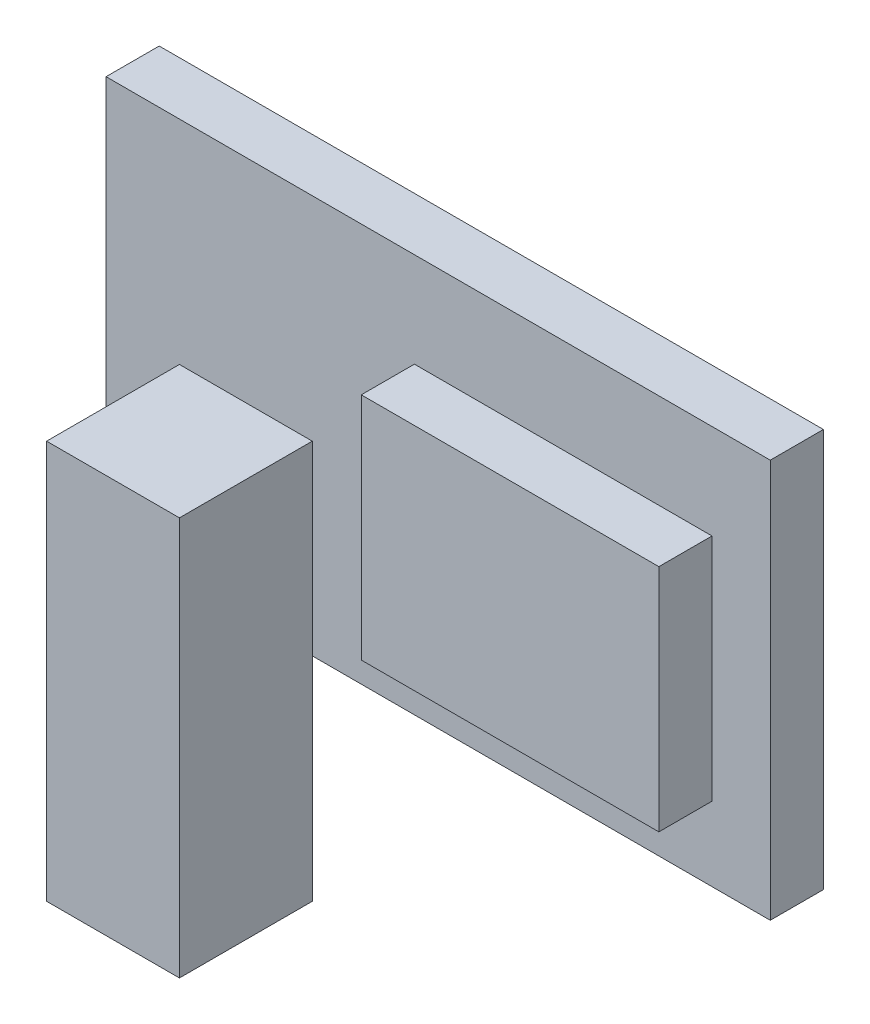
ISO-10303-21;
HEADER;
FILE_DESCRIPTION(('STEP AP214'),'2;1');
FILE_NAME('part.step','',(''),(''),'','','');
FILE_SCHEMA(('AUTOMOTIVE_DESIGN { 1 0 10303 214 1 1 1 1 }'));
ENDSEC;
DATA;
#1=APPLICATION_CONTEXT('core data for automotive mechanical design processes');
#2=APPLICATION_PROTOCOL_DEFINITION('international standard','automotive_design',2000,#1);
#3=PRODUCT_CONTEXT('',#1,'mechanical');
#4=PRODUCT('Part','Part','',(#3));
#5=PRODUCT_RELATED_PRODUCT_CATEGORY('part','',(#4));
#6=PRODUCT_DEFINITION_FORMATION('','',#4);
#7=PRODUCT_DEFINITION_CONTEXT('part definition',#1,'design');
#8=PRODUCT_DEFINITION('design','',#6,#7);
#9=PRODUCT_DEFINITION_SHAPE('','',#8);
#10=(LENGTH_UNIT() NAMED_UNIT(*) SI_UNIT(.MILLI.,.METRE.));
#11=(NAMED_UNIT(*) PLANE_ANGLE_UNIT() SI_UNIT($,.RADIAN.));
#12=(NAMED_UNIT(*) SI_UNIT($,.STERADIAN.) SOLID_ANGLE_UNIT());
#13=UNCERTAINTY_MEASURE_WITH_UNIT(LENGTH_MEASURE(1.E-05),#10,'distance_accuracy_value','');
#14=(GEOMETRIC_REPRESENTATION_CONTEXT(3) GLOBAL_UNCERTAINTY_ASSIGNED_CONTEXT((#13)) GLOBAL_UNIT_ASSIGNED_CONTEXT((#10,
#11,#12)) REPRESENTATION_CONTEXT('',''));
#15=CARTESIAN_POINT('',(0.,0.,0.));
#16=DIRECTION('',(0.,0.,1.));
#17=DIRECTION('',(1.,0.,0.));
#18=AXIS2_PLACEMENT_3D('',#15,#16,#17);
#19=CARTESIAN_POINT('',(0.,0.,2.));
#20=DIRECTION('',(0.,0.,1.));
#21=DIRECTION('',(1.,0.,0.));
#22=AXIS2_PLACEMENT_3D('',#19,#20,#21);
#23=PLANE('',#22);
#24=DIRECTION('',(0.,-1.,0.));
#25=VECTOR('',#24,1.);
#26=CARTESIAN_POINT('',(-11.5842220647906,-3.90346801005655,2.));
#27=LINE('',#26,#25);
#28=CARTESIAN_POINT('',(-11.5842220647906,-3.90346801005655,2.));
#29=VERTEX_POINT('',#28);
#30=CARTESIAN_POINT('',(-11.5842220647906,-10.9034680100565,2.));
#31=VERTEX_POINT('',#30);
#32=EDGE_CURVE('E223',#29,#31,#27,.T.);
#33=ORIENTED_EDGE('',*,*,#32,.F.);
#34=DIRECTION('',(-1.,0.,0.));
#35=VECTOR('',#34,1.);
#36=CARTESIAN_POINT('',(0.,-3.90346801005655,2.));
#37=LINE('',#36,#35);
#38=CARTESIAN_POINT('',(-6.5842220647906,-3.90346801005655,2.));
#39=VERTEX_POINT('',#38);
#40=EDGE_CURVE('E160',#39,#29,#37,.T.);
#41=ORIENTED_EDGE('',*,*,#40,.F.);
#42=DIRECTION('',(0.,-1.,0.));
#43=VECTOR('',#42,1.);
#44=CARTESIAN_POINT('',(-6.5842220647906,-3.90346801005655,2.));
#45=LINE('',#44,#43);
#46=CARTESIAN_POINT('',(-6.5842220647906,-10.9034680100565,2.));
#47=VERTEX_POINT('',#46);
#48=EDGE_CURVE('E219',#39,#47,#45,.T.);
#49=ORIENTED_EDGE('',*,*,#48,.T.);
#50=DIRECTION('',(1.,0.,0.));
#51=VECTOR('',#50,1.);
#52=CARTESIAN_POINT('',(-14.3456106753076,-10.9034680100565,2.));
#53=LINE('',#52,#51);
#54=CARTESIAN_POINT('',(10.6543893246924,-10.9034680100565,2.));
#55=VERTEX_POINT('',#54);
#56=EDGE_CURVE('E229',#47,#55,#53,.T.);
#57=ORIENTED_EDGE('',*,*,#56,.T.);
#58=DIRECTION('',(0.,1.,0.));
#59=VECTOR('',#58,1.);
#60=CARTESIAN_POINT('',(10.6543893246924,4.09653198994345,2.));
#61=LINE('',#60,#59);
#62=CARTESIAN_POINT('',(10.6543893246924,4.09653198994345,2.));
#63=VERTEX_POINT('',#62);
#64=EDGE_CURVE('E231',#55,#63,#61,.T.);
#65=ORIENTED_EDGE('',*,*,#64,.T.);
#66=DIRECTION('',(-1.,0.,0.));
#67=VECTOR('',#66,1.);
#68=CARTESIAN_POINT('',(-14.3456106753076,4.09653198994345,2.));
#69=LINE('',#68,#67);
#70=CARTESIAN_POINT('',(-14.3456106753076,4.09653198994345,2.));
#71=VERTEX_POINT('',#70);
#72=EDGE_CURVE('E65',#63,#71,#69,.T.);
#73=ORIENTED_EDGE('',*,*,#72,.T.);
#74=DIRECTION('',(0.,-1.,0.));
#75=VECTOR('',#74,1.);
#76=CARTESIAN_POINT('',(-14.3456106753076,4.09653198994345,2.));
#77=LINE('',#76,#75);
#78=CARTESIAN_POINT('',(-14.3456106753076,-10.9034680100565,2.));
#79=VERTEX_POINT('',#78);
#80=EDGE_CURVE('E227',#71,#79,#77,.T.);
#81=ORIENTED_EDGE('',*,*,#80,.T.);
#82=EDGE_CURVE('E94',#79,#31,#53,.T.);
#83=ORIENTED_EDGE('',*,*,#82,.T.);
#84=EDGE_LOOP('',(#33,#41,#49,#57,#65,#73,#81,#83));
#85=FACE_BOUND('',#84,.T.);
#86=DIRECTION('',(1.,0.,0.));
#87=VECTOR('',#86,1.);
#88=CARTESIAN_POINT('',(-2.73976641065943,-8.11726022862302,2.));
#89=LINE('',#88,#87);
#90=CARTESIAN_POINT('',(-2.73976641065943,-8.11726022862302,2.));
#91=VERTEX_POINT('',#90);
#92=CARTESIAN_POINT('',(8.46126873047659,-8.11726022862302,2.));
#93=VERTEX_POINT('',#92);
#94=EDGE_CURVE('E194',#91,#93,#89,.T.);
#95=ORIENTED_EDGE('',*,*,#94,.F.);
#96=DIRECTION('',(0.,-1.,0.));
#97=VECTOR('',#96,1.);
#98=CARTESIAN_POINT('',(-2.73976641065943,0.528644869987716,2.));
#99=LINE('',#98,#97);
#100=CARTESIAN_POINT('',(-2.73976641065943,0.528644869987716,2.));
#101=VERTEX_POINT('',#100);
#102=EDGE_CURVE('E180',#101,#91,#99,.T.);
#103=ORIENTED_EDGE('',*,*,#102,.F.);
#104=DIRECTION('',(-1.,0.,0.));
#105=VECTOR('',#104,1.);
#106=CARTESIAN_POINT('',(-2.73976641065943,0.528644869987716,2.));
#107=LINE('',#106,#105);
#108=CARTESIAN_POINT('',(8.46126873047659,0.528644869987716,2.));
#109=VERTEX_POINT('',#108);
#110=EDGE_CURVE('E185',#109,#101,#107,.T.);
#111=ORIENTED_EDGE('',*,*,#110,.F.);
#112=DIRECTION('',(0.,1.,0.));
#113=VECTOR('',#112,1.);
#114=CARTESIAN_POINT('',(8.46126873047659,0.528644869987716,2.));
#115=LINE('',#114,#113);
#116=EDGE_CURVE('E196',#93,#109,#115,.T.);
#117=ORIENTED_EDGE('',*,*,#116,.F.);
#118=EDGE_LOOP('',(#95,#103,#111,#117));
#119=FACE_BOUND('',#118,.T.);
#120=ADVANCED_FACE('F40',(#85,#119),#23,.T.);
#121=CARTESIAN_POINT('',(-14.3456106753076,4.09653198994345,2.));
#122=DIRECTION('',(1.,0.,0.));
#123=DIRECTION('',(0.,1.,0.));
#124=AXIS2_PLACEMENT_3D('',#121,#122,#123);
#125=PLANE('',#124);
#126=DIRECTION('',(0.,-1.,0.));
#127=VECTOR('',#126,1.);
#128=CARTESIAN_POINT('',(-14.3456106753076,4.09653198994345,0.));
#129=LINE('',#128,#127);
#130=CARTESIAN_POINT('',(-14.3456106753076,4.09653198994345,0.));
#131=VERTEX_POINT('',#130);
#132=CARTESIAN_POINT('',(-14.3456106753076,-10.9034680100565,0.));
#133=VERTEX_POINT('',#132);
#134=EDGE_CURVE('E222',#131,#133,#129,.T.);
#135=ORIENTED_EDGE('',*,*,#134,.T.);
#136=DIRECTION('',(0.,0.,-1.));
#137=VECTOR('',#136,1.);
#138=CARTESIAN_POINT('',(-14.3456106753076,-10.9034680100565,2.));
#139=LINE('',#138,#137);
#140=EDGE_CURVE('E44',#79,#133,#139,.T.);
#141=ORIENTED_EDGE('',*,*,#140,.F.);
#142=ORIENTED_EDGE('',*,*,#80,.F.);
#143=DIRECTION('',(0.,0.,-1.));
#144=VECTOR('',#143,1.);
#145=CARTESIAN_POINT('',(-14.3456106753076,4.09653198994345,2.));
#146=LINE('',#145,#144);
#147=EDGE_CURVE('E234',#71,#131,#146,.T.);
#148=ORIENTED_EDGE('',*,*,#147,.T.);
#149=EDGE_LOOP('',(#135,#141,#142,#148));
#150=FACE_BOUND('',#149,.T.);
#151=ADVANCED_FACE('F42',(#150),#125,.F.);
#152=CARTESIAN_POINT('',(-14.3456106753076,-10.9034680100565,2.));
#153=DIRECTION('',(0.,1.,0.));
#154=DIRECTION('',(0.,0.,1.));
#155=AXIS2_PLACEMENT_3D('',#152,#153,#154);
#156=PLANE('',#155);
#157=ORIENTED_EDGE('',*,*,#56,.F.);
#158=DIRECTION('',(-1.,0.,0.));
#159=VECTOR('',#158,1.);
#160=CARTESIAN_POINT('',(0.,-10.9034680100565,2.));
#161=LINE('',#160,#159);
#162=EDGE_CURVE('E207',#47,#31,#161,.T.);
#163=ORIENTED_EDGE('',*,*,#162,.T.);
#164=ORIENTED_EDGE('',*,*,#82,.F.);
#165=ORIENTED_EDGE('',*,*,#140,.T.);
#166=DIRECTION('',(1.,0.,0.));
#167=VECTOR('',#166,1.);
#168=CARTESIAN_POINT('',(-14.3456106753076,-10.9034680100565,0.));
#169=LINE('',#168,#167);
#170=CARTESIAN_POINT('',(10.6543893246924,-10.9034680100565,0.));
#171=VERTEX_POINT('',#170);
#172=EDGE_CURVE('E237',#133,#171,#169,.T.);
#173=ORIENTED_EDGE('',*,*,#172,.T.);
#174=DIRECTION('',(0.,0.,-1.));
#175=VECTOR('',#174,1.);
#176=CARTESIAN_POINT('',(10.6543893246924,-10.9034680100565,2.));
#177=LINE('',#176,#175);
#178=EDGE_CURVE('E244',#55,#171,#177,.T.);
#179=ORIENTED_EDGE('',*,*,#178,.F.);
#180=EDGE_LOOP('',(#157,#163,#164,#165,#173,#179));
#181=FACE_BOUND('',#180,.T.);
#182=ADVANCED_FACE('F252',(#181),#156,.F.);
#183=CARTESIAN_POINT('',(10.6543893246924,4.09653198994345,2.));
#184=DIRECTION('',(-1.,0.,0.));
#185=DIRECTION('',(0.,-1.,0.));
#186=AXIS2_PLACEMENT_3D('',#183,#184,#185);
#187=PLANE('',#186);
#188=DIRECTION('',(0.,1.,0.));
#189=VECTOR('',#188,1.);
#190=CARTESIAN_POINT('',(10.6543893246924,4.09653198994345,0.));
#191=LINE('',#190,#189);
#192=CARTESIAN_POINT('',(10.6543893246924,4.09653198994345,0.));
#193=VERTEX_POINT('',#192);
#194=EDGE_CURVE('E239',#171,#193,#191,.T.);
#195=ORIENTED_EDGE('',*,*,#194,.T.);
#196=DIRECTION('',(0.,0.,-1.));
#197=VECTOR('',#196,1.);
#198=CARTESIAN_POINT('',(10.6543893246924,4.09653198994345,2.));
#199=LINE('',#198,#197);
#200=EDGE_CURVE('E243',#63,#193,#199,.T.);
#201=ORIENTED_EDGE('',*,*,#200,.F.);
#202=ORIENTED_EDGE('',*,*,#64,.F.);
#203=ORIENTED_EDGE('',*,*,#178,.T.);
#204=EDGE_LOOP('',(#195,#201,#202,#203));
#205=FACE_BOUND('',#204,.T.);
#206=ADVANCED_FACE('F259',(#205),#187,.F.);
#207=CARTESIAN_POINT('',(-14.3456106753076,4.09653198994345,2.));
#208=DIRECTION('',(0.,-1.,0.));
#209=DIRECTION('',(0.,0.,-1.));
#210=AXIS2_PLACEMENT_3D('',#207,#208,#209);
#211=PLANE('',#210);
#212=DIRECTION('',(-1.,0.,0.));
#213=VECTOR('',#212,1.);
#214=CARTESIAN_POINT('',(-14.3456106753076,4.09653198994345,0.));
#215=LINE('',#214,#213);
#216=EDGE_CURVE('E86',#193,#131,#215,.T.);
#217=ORIENTED_EDGE('',*,*,#216,.T.);
#218=ORIENTED_EDGE('',*,*,#147,.F.);
#219=ORIENTED_EDGE('',*,*,#72,.F.);
#220=ORIENTED_EDGE('',*,*,#200,.T.);
#221=EDGE_LOOP('',(#217,#218,#219,#220));
#222=FACE_BOUND('',#221,.T.);
#223=ADVANCED_FACE('F260',(#222),#211,.F.);
#224=CARTESIAN_POINT('',(0.,0.,0.));
#225=DIRECTION('',(0.,0.,1.));
#226=DIRECTION('',(1.,0.,0.));
#227=AXIS2_PLACEMENT_3D('',#224,#225,#226);
#228=PLANE('',#227);
#229=ORIENTED_EDGE('',*,*,#134,.F.);
#230=ORIENTED_EDGE('',*,*,#216,.F.);
#231=ORIENTED_EDGE('',*,*,#194,.F.);
#232=ORIENTED_EDGE('',*,*,#172,.F.);
#233=EDGE_LOOP('',(#229,#230,#231,#232));
#234=FACE_BOUND('',#233,.T.);
#235=ADVANCED_FACE('F257',(#234),#228,.F.);
#236=CARTESIAN_POINT('',(-6.58422206479059,-3.90346801005655,0.));
#237=DIRECTION('',(-1.,0.,0.));
#238=DIRECTION('',(0.,0.,1.));
#239=AXIS2_PLACEMENT_3D('',#236,#237,#238);
#240=PLANE('',#239);
#241=DIRECTION('',(0.,1.,0.));
#242=VECTOR('',#241,1.);
#243=CARTESIAN_POINT('',(-6.5842220647906,-12.9034680100565,2.));
#244=LINE('',#243,#242);
#245=CARTESIAN_POINT('',(-6.5842220647906,-18.9034680100565,2.));
#246=VERTEX_POINT('',#245);
#247=EDGE_CURVE('E209',#246,#47,#244,.T.);
#248=ORIENTED_EDGE('',*,*,#247,.T.);
#249=ORIENTED_EDGE('',*,*,#48,.F.);
#250=DIRECTION('',(0.,0.,-1.));
#251=VECTOR('',#250,1.);
#252=CARTESIAN_POINT('',(-6.58422206479059,-3.90346801005655,0.));
#253=LINE('',#252,#251);
#254=CARTESIAN_POINT('',(-6.5842220647906,-3.90346801005655,7.));
#255=VERTEX_POINT('',#254);
#256=EDGE_CURVE('E155',#255,#39,#253,.T.);
#257=ORIENTED_EDGE('',*,*,#256,.F.);
#258=DIRECTION('',(0.,-1.,0.));
#259=VECTOR('',#258,1.);
#260=CARTESIAN_POINT('',(-6.5842220647906,-3.90346801005655,7.));
#261=LINE('',#260,#259);
#262=CARTESIAN_POINT('',(-6.5842220647906,-18.9034680100565,7.));
#263=VERTEX_POINT('',#262);
#264=EDGE_CURVE('E149',#255,#263,#261,.T.);
#265=ORIENTED_EDGE('',*,*,#264,.T.);
#266=DIRECTION('',(0.,0.,-1.));
#267=VECTOR('',#266,1.);
#268=CARTESIAN_POINT('',(-6.58422206479059,-18.9034680100565,0.));
#269=LINE('',#268,#267);
#270=EDGE_CURVE('E152',#263,#246,#269,.T.);
#271=ORIENTED_EDGE('',*,*,#270,.T.);
#272=EDGE_LOOP('',(#248,#249,#257,#265,#271));
#273=FACE_BOUND('',#272,.T.);
#274=ADVANCED_FACE('F151',(#273),#240,.F.);
#275=CARTESIAN_POINT('',(-11.5842220647906,-3.90346801005655,0.));
#276=DIRECTION('',(1.,0.,0.));
#277=DIRECTION('',(0.,0.,-1.));
#278=AXIS2_PLACEMENT_3D('',#275,#276,#277);
#279=PLANE('',#278);
#280=DIRECTION('',(0.,0.,1.));
#281=VECTOR('',#280,1.);
#282=CARTESIAN_POINT('',(-11.5842220647906,-18.9034680100565,0.));
#283=LINE('',#282,#281);
#284=CARTESIAN_POINT('',(-11.5842220647906,-18.9034680100565,2.));
#285=VERTEX_POINT('',#284);
#286=CARTESIAN_POINT('',(-11.5842220647906,-18.9034680100565,7.));
#287=VERTEX_POINT('',#286);
#288=EDGE_CURVE('E174',#285,#287,#283,.T.);
#289=ORIENTED_EDGE('',*,*,#288,.T.);
#290=DIRECTION('',(0.,-1.,0.));
#291=VECTOR('',#290,1.);
#292=CARTESIAN_POINT('',(-11.5842220647906,-3.90346801005655,7.));
#293=LINE('',#292,#291);
#294=CARTESIAN_POINT('',(-11.5842220647906,-3.90346801005655,7.));
#295=VERTEX_POINT('',#294);
#296=EDGE_CURVE('E159',#295,#287,#293,.T.);
#297=ORIENTED_EDGE('',*,*,#296,.F.);
#298=DIRECTION('',(0.,0.,1.));
#299=VECTOR('',#298,1.);
#300=CARTESIAN_POINT('',(-11.5842220647906,-3.90346801005655,0.));
#301=LINE('',#300,#299);
#302=EDGE_CURVE('E216',#29,#295,#301,.T.);
#303=ORIENTED_EDGE('',*,*,#302,.F.);
#304=ORIENTED_EDGE('',*,*,#32,.T.);
#305=DIRECTION('',(0.,1.,0.));
#306=VECTOR('',#305,1.);
#307=CARTESIAN_POINT('',(-11.5842220647906,-12.9034680100565,2.));
#308=LINE('',#307,#306);
#309=EDGE_CURVE('E211',#285,#31,#308,.T.);
#310=ORIENTED_EDGE('',*,*,#309,.F.);
#311=EDGE_LOOP('',(#289,#297,#303,#304,#310));
#312=FACE_BOUND('',#311,.T.);
#313=ADVANCED_FACE('F266',(#312),#279,.F.);
#314=CARTESIAN_POINT('',(0.,-3.90346801005655,7.));
#315=DIRECTION('',(0.,0.,-1.));
#316=DIRECTION('',(-1.,0.,0.));
#317=AXIS2_PLACEMENT_3D('',#314,#315,#316);
#318=PLANE('',#317);
#319=DIRECTION('',(1.,0.,0.));
#320=VECTOR('',#319,1.);
#321=CARTESIAN_POINT('',(0.,-18.9034680100565,7.));
#322=LINE('',#321,#320);
#323=EDGE_CURVE('E166',#287,#263,#322,.T.);
#324=ORIENTED_EDGE('',*,*,#323,.T.);
#325=ORIENTED_EDGE('',*,*,#264,.F.);
#326=DIRECTION('',(1.,0.,0.));
#327=VECTOR('',#326,1.);
#328=CARTESIAN_POINT('',(0.,-3.90346801005655,7.));
#329=LINE('',#328,#327);
#330=EDGE_CURVE('E214',#295,#255,#329,.T.);
#331=ORIENTED_EDGE('',*,*,#330,.F.);
#332=ORIENTED_EDGE('',*,*,#296,.T.);
#333=EDGE_LOOP('',(#324,#325,#331,#332));
#334=FACE_BOUND('',#333,.T.);
#335=ADVANCED_FACE('F172',(#334),#318,.F.);
#336=CARTESIAN_POINT('',(0.,-3.90346801005655,0.));
#337=DIRECTION('',(0.,-1.,0.));
#338=DIRECTION('',(0.,0.,-1.));
#339=AXIS2_PLACEMENT_3D('',#336,#337,#338);
#340=PLANE('',#339);
#341=ORIENTED_EDGE('',*,*,#256,.T.);
#342=ORIENTED_EDGE('',*,*,#40,.T.);
#343=ORIENTED_EDGE('',*,*,#302,.T.);
#344=ORIENTED_EDGE('',*,*,#330,.T.);
#345=EDGE_LOOP('',(#341,#342,#343,#344));
#346=FACE_BOUND('',#345,.T.);
#347=ADVANCED_FACE('F268',(#346),#340,.F.);
#348=CARTESIAN_POINT('',(0.,-12.9034680100565,2.));
#349=DIRECTION('',(0.,0.,-1.));
#350=DIRECTION('',(-1.,0.,0.));
#351=AXIS2_PLACEMENT_3D('',#348,#349,#350);
#352=PLANE('',#351);
#353=ORIENTED_EDGE('',*,*,#162,.F.);
#354=ORIENTED_EDGE('',*,*,#247,.F.);
#355=DIRECTION('',(-1.,0.,0.));
#356=VECTOR('',#355,1.);
#357=CARTESIAN_POINT('',(0.,-18.9034680100565,2.));
#358=LINE('',#357,#356);
#359=EDGE_CURVE('E169',#246,#285,#358,.T.);
#360=ORIENTED_EDGE('',*,*,#359,.T.);
#361=ORIENTED_EDGE('',*,*,#309,.T.);
#362=EDGE_LOOP('',(#353,#354,#360,#361));
#363=FACE_BOUND('',#362,.T.);
#364=ADVANCED_FACE('F271',(#363),#352,.T.);
#365=CARTESIAN_POINT('',(-2.73976641065943,0.528644869987716,4.));
#366=DIRECTION('',(1.,0.,0.));
#367=DIRECTION('',(0.,0.,-1.));
#368=AXIS2_PLACEMENT_3D('',#365,#366,#367);
#369=PLANE('',#368);
#370=ORIENTED_EDGE('',*,*,#102,.T.);
#371=DIRECTION('',(0.,0.,-1.));
#372=VECTOR('',#371,1.);
#373=CARTESIAN_POINT('',(-2.73976641065943,-8.11726022862302,4.));
#374=LINE('',#373,#372);
#375=CARTESIAN_POINT('',(-2.73976641065943,-8.11726022862302,4.));
#376=VERTEX_POINT('',#375);
#377=EDGE_CURVE('E205',#376,#91,#374,.T.);
#378=ORIENTED_EDGE('',*,*,#377,.F.);
#379=DIRECTION('',(0.,-1.,0.));
#380=VECTOR('',#379,1.);
#381=CARTESIAN_POINT('',(-2.73976641065943,0.528644869987716,4.));
#382=LINE('',#381,#380);
#383=CARTESIAN_POINT('',(-2.73976641065943,0.528644869987716,4.));
#384=VERTEX_POINT('',#383);
#385=EDGE_CURVE('E181',#384,#376,#382,.T.);
#386=ORIENTED_EDGE('',*,*,#385,.F.);
#387=DIRECTION('',(0.,0.,-1.));
#388=VECTOR('',#387,1.);
#389=CARTESIAN_POINT('',(-2.73976641065943,0.528644869987716,4.));
#390=LINE('',#389,#388);
#391=EDGE_CURVE('E191',#384,#101,#390,.T.);
#392=ORIENTED_EDGE('',*,*,#391,.T.);
#393=EDGE_LOOP('',(#370,#378,#386,#392));
#394=FACE_BOUND('',#393,.T.);
#395=ADVANCED_FACE('F273',(#394),#369,.F.);
#396=CARTESIAN_POINT('',(-2.73976641065943,-8.11726022862302,4.));
#397=DIRECTION('',(0.,1.,0.));
#398=DIRECTION('',(0.,0.,1.));
#399=AXIS2_PLACEMENT_3D('',#396,#397,#398);
#400=PLANE('',#399);
#401=ORIENTED_EDGE('',*,*,#94,.T.);
#402=DIRECTION('',(0.,0.,-1.));
#403=VECTOR('',#402,1.);
#404=CARTESIAN_POINT('',(8.46126873047659,-8.11726022862302,4.));
#405=LINE('',#404,#403);
#406=CARTESIAN_POINT('',(8.46126873047659,-8.11726022862302,4.));
#407=VERTEX_POINT('',#406);
#408=EDGE_CURVE('E202',#407,#93,#405,.T.);
#409=ORIENTED_EDGE('',*,*,#408,.F.);
#410=DIRECTION('',(1.,0.,0.));
#411=VECTOR('',#410,1.);
#412=CARTESIAN_POINT('',(-2.73976641065943,-8.11726022862302,4.));
#413=LINE('',#412,#411);
#414=EDGE_CURVE('E184',#376,#407,#413,.T.);
#415=ORIENTED_EDGE('',*,*,#414,.F.);
#416=ORIENTED_EDGE('',*,*,#377,.T.);
#417=EDGE_LOOP('',(#401,#409,#415,#416));
#418=FACE_BOUND('',#417,.T.);
#419=ADVANCED_FACE('F279',(#418),#400,.F.);
#420=CARTESIAN_POINT('',(8.46126873047659,0.528644869987716,4.));
#421=DIRECTION('',(-1.,0.,0.));
#422=DIRECTION('',(0.,0.,1.));
#423=AXIS2_PLACEMENT_3D('',#420,#421,#422);
#424=PLANE('',#423);
#425=ORIENTED_EDGE('',*,*,#116,.T.);
#426=DIRECTION('',(0.,0.,-1.));
#427=VECTOR('',#426,1.);
#428=CARTESIAN_POINT('',(8.46126873047659,0.528644869987716,4.));
#429=LINE('',#428,#427);
#430=CARTESIAN_POINT('',(8.46126873047659,0.528644869987716,4.));
#431=VERTEX_POINT('',#430);
#432=EDGE_CURVE('E56',#431,#109,#429,.T.);
#433=ORIENTED_EDGE('',*,*,#432,.F.);
#434=DIRECTION('',(0.,1.,0.));
#435=VECTOR('',#434,1.);
#436=CARTESIAN_POINT('',(8.46126873047659,0.528644869987716,4.));
#437=LINE('',#436,#435);
#438=EDGE_CURVE('E187',#407,#431,#437,.T.);
#439=ORIENTED_EDGE('',*,*,#438,.F.);
#440=ORIENTED_EDGE('',*,*,#408,.T.);
#441=EDGE_LOOP('',(#425,#433,#439,#440));
#442=FACE_BOUND('',#441,.T.);
#443=ADVANCED_FACE('F414',(#442),#424,.F.);
#444=CARTESIAN_POINT('',(-2.73976641065943,0.528644869987716,4.));
#445=DIRECTION('',(0.,-1.,0.));
#446=DIRECTION('',(0.,0.,-1.));
#447=AXIS2_PLACEMENT_3D('',#444,#445,#446);
#448=PLANE('',#447);
#449=ORIENTED_EDGE('',*,*,#110,.T.);
#450=ORIENTED_EDGE('',*,*,#391,.F.);
#451=DIRECTION('',(-1.,0.,0.));
#452=VECTOR('',#451,1.);
#453=CARTESIAN_POINT('',(-2.73976641065943,0.528644869987716,4.));
#454=LINE('',#453,#452);
#455=EDGE_CURVE('E189',#431,#384,#454,.T.);
#456=ORIENTED_EDGE('',*,*,#455,.F.);
#457=ORIENTED_EDGE('',*,*,#432,.T.);
#458=EDGE_LOOP('',(#449,#450,#456,#457));
#459=FACE_BOUND('',#458,.T.);
#460=ADVANCED_FACE('F405',(#459),#448,.F.);
#461=CARTESIAN_POINT('',(0.,0.,4.));
#462=DIRECTION('',(0.,0.,1.));
#463=DIRECTION('',(1.,0.,0.));
#464=AXIS2_PLACEMENT_3D('',#461,#462,#463);
#465=PLANE('',#464);
#466=ORIENTED_EDGE('',*,*,#385,.T.);
#467=ORIENTED_EDGE('',*,*,#414,.T.);
#468=ORIENTED_EDGE('',*,*,#438,.T.);
#469=ORIENTED_EDGE('',*,*,#455,.T.);
#470=EDGE_LOOP('',(#466,#467,#468,#469));
#471=FACE_BOUND('',#470,.T.);
#472=ADVANCED_FACE('F368',(#471),#465,.T.);
#473=CARTESIAN_POINT('',(0.,-18.9034680100565,0.));
#474=DIRECTION('',(0.,-1.,0.));
#475=DIRECTION('',(0.,0.,-1.));
#476=AXIS2_PLACEMENT_3D('',#473,#474,#475);
#477=PLANE('',#476);
#478=CARTESIAN_POINT('',(-9.06491676539062,-18.9034680100565,4.5));
#479=DIRECTION('',(0.,-1.,0.));
#480=DIRECTION('',(0.,0.,-1.));
#481=AXIS2_PLACEMENT_3D('',#478,#479,#480);
#482=CIRCLE('',#481,1.75);
#483=CARTESIAN_POINT('',(-9.06491676539062,-18.9034680100565,2.75));
#484=VERTEX_POINT('',#483);
#485=EDGE_CURVE('E170',#484,#484,#482,.T.);
#486=ORIENTED_EDGE('',*,*,#485,.F.);
#487=EDGE_LOOP('',(#486));
#488=FACE_BOUND('',#487,.T.);
#489=ORIENTED_EDGE('',*,*,#270,.F.);
#490=ORIENTED_EDGE('',*,*,#323,.F.);
#491=ORIENTED_EDGE('',*,*,#288,.F.);
#492=ORIENTED_EDGE('',*,*,#359,.F.);
#493=EDGE_LOOP('',(#489,#490,#491,#492));
#494=FACE_BOUND('',#493,.T.);
#495=ADVANCED_FACE('F164',(#488,#494),#477,.T.);
#496=CARTESIAN_POINT('',(0.,-5.90346801005655,0.));
#497=DIRECTION('',(0.,1.,0.));
#498=DIRECTION('',(0.,0.,1.));
#499=AXIS2_PLACEMENT_3D('',#496,#497,#498);
#500=PLANE('',#499);
#501=CARTESIAN_POINT('',(-9.06491676539062,-5.90346801005655,4.5));
#502=DIRECTION('',(0.,1.,0.));
#503=DIRECTION('',(0.,0.,1.));
#504=AXIS2_PLACEMENT_3D('',#501,#502,#503);
#505=CIRCLE('',#504,1.75);
#506=CARTESIAN_POINT('',(-9.06491676539062,-5.90346801005655,6.25));
#507=VERTEX_POINT('',#506);
#508=EDGE_CURVE('E11',#507,#507,#505,.F.);
#509=ORIENTED_EDGE('',*,*,#508,.T.);
#510=EDGE_LOOP('',(#509));
#511=FACE_BOUND('',#510,.T.);
#512=ADVANCED_FACE('F345',(#511),#500,.F.);
#513=CARTESIAN_POINT('',(-9.06491676539062,-3.90346801005655,4.5));
#514=DIRECTION('',(0.,-1.,0.));
#515=DIRECTION('',(0.,0.,-1.));
#516=AXIS2_PLACEMENT_3D('',#513,#514,#515);
#517=CYLINDRICAL_SURFACE('',#516,1.75);
#518=ORIENTED_EDGE('',*,*,#508,.F.);
#519=EDGE_LOOP('',(#518));
#520=FACE_BOUND('',#519,.T.);
#521=ORIENTED_EDGE('',*,*,#485,.T.);
#522=EDGE_LOOP('',(#521));
#523=FACE_BOUND('',#522,.T.);
#524=ADVANCED_FACE('F291',(#520,#523),#517,.F.);
#525=CLOSED_SHELL('',(#120,#151,#182,#206,#223,#235,#274,#313,#335,#347,#364,#395,#419,#443,
#460,#472,#495,#512,#524));
#526=MANIFOLD_SOLID_BREP('B2',#525);
#527=ADVANCED_BREP_SHAPE_REPRESENTATION('',(#18,#526),#14);
#528=SHAPE_DEFINITION_REPRESENTATION(#9,#527);
ENDSEC;
END-ISO-10303-21;
